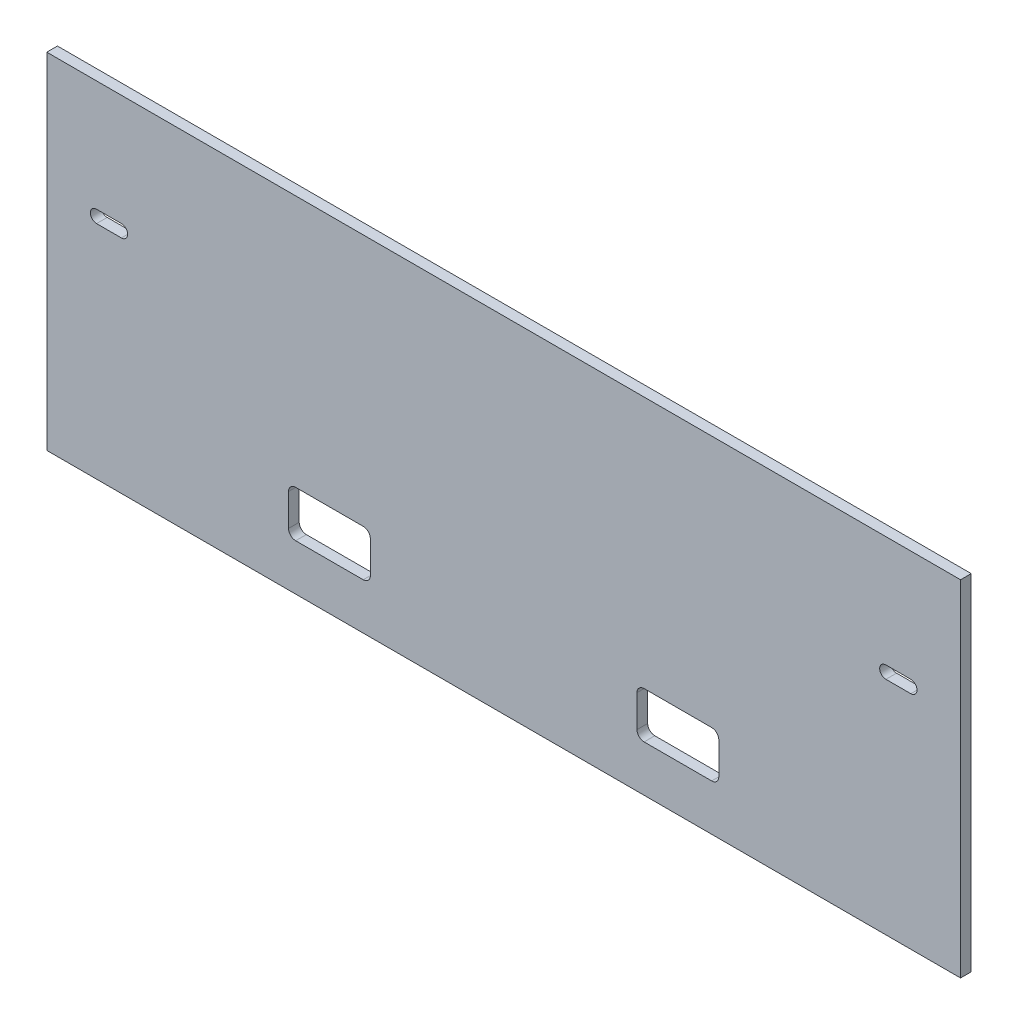
ISO-10303-21;
HEADER;
FILE_DESCRIPTION(('STEP AP214'),'2;1');
FILE_NAME('part.step','',(''),(''),'','','');
FILE_SCHEMA(('AUTOMOTIVE_DESIGN { 1 0 10303 214 1 1 1 1 }'));
ENDSEC;
DATA;
#1=APPLICATION_CONTEXT('core data for automotive mechanical design processes');
#2=APPLICATION_PROTOCOL_DEFINITION('international standard','automotive_design',2000,#1);
#3=PRODUCT_CONTEXT('',#1,'mechanical');
#4=PRODUCT('Part','Part','',(#3));
#5=PRODUCT_RELATED_PRODUCT_CATEGORY('part','',(#4));
#6=PRODUCT_DEFINITION_FORMATION('','',#4);
#7=PRODUCT_DEFINITION_CONTEXT('part definition',#1,'design');
#8=PRODUCT_DEFINITION('design','',#6,#7);
#9=PRODUCT_DEFINITION_SHAPE('','',#8);
#10=(LENGTH_UNIT() NAMED_UNIT(*) SI_UNIT(.MILLI.,.METRE.));
#11=(NAMED_UNIT(*) PLANE_ANGLE_UNIT() SI_UNIT($,.RADIAN.));
#12=(NAMED_UNIT(*) SI_UNIT($,.STERADIAN.) SOLID_ANGLE_UNIT());
#13=UNCERTAINTY_MEASURE_WITH_UNIT(LENGTH_MEASURE(1.E-05),#10,'distance_accuracy_value','');
#14=(GEOMETRIC_REPRESENTATION_CONTEXT(3) GLOBAL_UNCERTAINTY_ASSIGNED_CONTEXT((#13)) GLOBAL_UNIT_ASSIGNED_CONTEXT((#10,
#11,#12)) REPRESENTATION_CONTEXT('',''));
#15=CARTESIAN_POINT('',(0.,0.,0.));
#16=DIRECTION('',(0.,0.,1.));
#17=DIRECTION('',(1.,0.,0.));
#18=AXIS2_PLACEMENT_3D('',#15,#16,#17);
#19=CARTESIAN_POINT('',(0.,0.,3.));
#20=DIRECTION('',(0.,0.,-1.));
#21=DIRECTION('',(-1.,0.,0.));
#22=AXIS2_PLACEMENT_3D('',#19,#20,#21);
#23=PLANE('',#22);
#24=DIRECTION('',(1.,0.,0.));
#25=VECTOR('',#24,1.);
#26=CARTESIAN_POINT('',(-60.5,-35.5,3.));
#27=LINE('',#26,#25);
#28=CARTESIAN_POINT('',(-58.5,-35.5,3.));
#29=VERTEX_POINT('',#28);
#30=CARTESIAN_POINT('',(-39.5,-35.5,3.));
#31=VERTEX_POINT('',#30);
#32=EDGE_CURVE('E424',#29,#31,#27,.T.);
#33=ORIENTED_EDGE('',*,*,#32,.F.);
#34=CARTESIAN_POINT('',(-58.5,-33.5,3.));
#35=DIRECTION('',(0.,0.,-1.));
#36=DIRECTION('',(-1.,0.,0.));
#37=AXIS2_PLACEMENT_3D('',#34,#35,#36);
#38=CIRCLE('',#37,2.);
#39=CARTESIAN_POINT('',(-60.5,-33.5,3.));
#40=VERTEX_POINT('',#39);
#41=EDGE_CURVE('E388',#29,#40,#38,.T.);
#42=ORIENTED_EDGE('',*,*,#41,.T.);
#43=DIRECTION('',(0.,-1.,0.));
#44=VECTOR('',#43,1.);
#45=CARTESIAN_POINT('',(-60.5,-35.5,3.));
#46=LINE('',#45,#44);
#47=CARTESIAN_POINT('',(-60.5,-24.5,3.));
#48=VERTEX_POINT('',#47);
#49=EDGE_CURVE('E405',#48,#40,#46,.T.);
#50=ORIENTED_EDGE('',*,*,#49,.F.);
#51=CARTESIAN_POINT('',(-58.5,-24.5,3.));
#52=DIRECTION('',(0.,0.,-1.));
#53=DIRECTION('',(-1.,0.,0.));
#54=AXIS2_PLACEMENT_3D('',#51,#52,#53);
#55=CIRCLE('',#54,2.);
#56=CARTESIAN_POINT('',(-58.5,-22.5,3.));
#57=VERTEX_POINT('',#56);
#58=EDGE_CURVE('E51',#48,#57,#55,.T.);
#59=ORIENTED_EDGE('',*,*,#58,.T.);
#60=DIRECTION('',(-1.,0.,0.));
#61=VECTOR('',#60,1.);
#62=CARTESIAN_POINT('',(-60.5,-22.5,3.));
#63=LINE('',#62,#61);
#64=CARTESIAN_POINT('',(-39.5,-22.5,3.));
#65=VERTEX_POINT('',#64);
#66=EDGE_CURVE('E403',#65,#57,#63,.T.);
#67=ORIENTED_EDGE('',*,*,#66,.F.);
#68=CARTESIAN_POINT('',(-39.5,-24.5,3.));
#69=DIRECTION('',(0.,0.,-1.));
#70=DIRECTION('',(-1.,0.,0.));
#71=AXIS2_PLACEMENT_3D('',#68,#69,#70);
#72=CIRCLE('',#71,2.);
#73=CARTESIAN_POINT('',(-37.5,-24.5,3.));
#74=VERTEX_POINT('',#73);
#75=EDGE_CURVE('E396',#65,#74,#72,.T.);
#76=ORIENTED_EDGE('',*,*,#75,.T.);
#77=DIRECTION('',(0.,1.,0.));
#78=VECTOR('',#77,1.);
#79=CARTESIAN_POINT('',(-37.5,-35.5,3.));
#80=LINE('',#79,#78);
#81=CARTESIAN_POINT('',(-37.5,-33.5,3.));
#82=VERTEX_POINT('',#81);
#83=EDGE_CURVE('E410',#82,#74,#80,.T.);
#84=ORIENTED_EDGE('',*,*,#83,.F.);
#85=CARTESIAN_POINT('',(-39.5,-33.5,3.));
#86=DIRECTION('',(0.,0.,-1.));
#87=DIRECTION('',(-1.,0.,0.));
#88=AXIS2_PLACEMENT_3D('',#85,#86,#87);
#89=CIRCLE('',#88,2.);
#90=EDGE_CURVE('E392',#82,#31,#89,.T.);
#91=ORIENTED_EDGE('',*,*,#90,.T.);
#92=EDGE_LOOP('',(#33,#42,#50,#59,#67,#76,#84,#91));
#93=FACE_BOUND('',#92,.T.);
#94=DIRECTION('',(1.,0.,0.));
#95=VECTOR('',#94,1.);
#96=CARTESIAN_POINT('',(37.5,-35.5,3.));
#97=LINE('',#96,#95);
#98=CARTESIAN_POINT('',(39.5,-35.5,3.));
#99=VERTEX_POINT('',#98);
#100=CARTESIAN_POINT('',(58.5,-35.5,3.));
#101=VERTEX_POINT('',#100);
#102=EDGE_CURVE('E445',#99,#101,#97,.T.);
#103=ORIENTED_EDGE('',*,*,#102,.F.);
#104=CARTESIAN_POINT('',(39.5,-33.5,3.));
#105=DIRECTION('',(0.,0.,-1.));
#106=DIRECTION('',(-1.,0.,0.));
#107=AXIS2_PLACEMENT_3D('',#104,#105,#106);
#108=CIRCLE('',#107,2.);
#109=CARTESIAN_POINT('',(37.5,-33.5,3.));
#110=VERTEX_POINT('',#109);
#111=EDGE_CURVE('E372',#99,#110,#108,.T.);
#112=ORIENTED_EDGE('',*,*,#111,.T.);
#113=DIRECTION('',(0.,-1.,0.));
#114=VECTOR('',#113,1.);
#115=CARTESIAN_POINT('',(37.5,-35.5,3.));
#116=LINE('',#115,#114);
#117=CARTESIAN_POINT('',(37.5,-24.5,3.));
#118=VERTEX_POINT('',#117);
#119=EDGE_CURVE('E448',#118,#110,#116,.T.);
#120=ORIENTED_EDGE('',*,*,#119,.F.);
#121=CARTESIAN_POINT('',(39.5,-24.5,3.));
#122=DIRECTION('',(0.,0.,-1.));
#123=DIRECTION('',(-1.,0.,0.));
#124=AXIS2_PLACEMENT_3D('',#121,#122,#123);
#125=CIRCLE('',#124,2.);
#126=CARTESIAN_POINT('',(39.5,-22.5,3.));
#127=VERTEX_POINT('',#126);
#128=EDGE_CURVE('E384',#118,#127,#125,.T.);
#129=ORIENTED_EDGE('',*,*,#128,.T.);
#130=DIRECTION('',(-1.,0.,0.));
#131=VECTOR('',#130,1.);
#132=CARTESIAN_POINT('',(37.5,-22.5,3.));
#133=LINE('',#132,#131);
#134=CARTESIAN_POINT('',(58.5,-22.5,3.));
#135=VERTEX_POINT('',#134);
#136=EDGE_CURVE('E439',#135,#127,#133,.T.);
#137=ORIENTED_EDGE('',*,*,#136,.F.);
#138=CARTESIAN_POINT('',(58.5,-24.5,3.));
#139=DIRECTION('',(0.,0.,-1.));
#140=DIRECTION('',(-1.,0.,0.));
#141=AXIS2_PLACEMENT_3D('',#138,#139,#140);
#142=CIRCLE('',#141,2.);
#143=CARTESIAN_POINT('',(60.5,-24.5,3.));
#144=VERTEX_POINT('',#143);
#145=EDGE_CURVE('E380',#135,#144,#142,.T.);
#146=ORIENTED_EDGE('',*,*,#145,.T.);
#147=DIRECTION('',(0.,1.,0.));
#148=VECTOR('',#147,1.);
#149=CARTESIAN_POINT('',(60.5,-35.5,3.));
#150=LINE('',#149,#148);
#151=CARTESIAN_POINT('',(60.5,-33.5,3.));
#152=VERTEX_POINT('',#151);
#153=EDGE_CURVE('E442',#152,#144,#150,.T.);
#154=ORIENTED_EDGE('',*,*,#153,.F.);
#155=CARTESIAN_POINT('',(58.5,-33.5,3.));
#156=DIRECTION('',(0.,0.,-1.));
#157=DIRECTION('',(-1.,0.,0.));
#158=AXIS2_PLACEMENT_3D('',#155,#156,#157);
#159=CIRCLE('',#158,2.);
#160=EDGE_CURVE('E376',#152,#101,#159,.T.);
#161=ORIENTED_EDGE('',*,*,#160,.T.);
#162=EDGE_LOOP('',(#103,#112,#120,#129,#137,#146,#154,#161));
#163=FACE_BOUND('',#162,.T.);
#164=CARTESIAN_POINT('',(-114.5,15.5,3.));
#165=DIRECTION('',(0.,0.,1.));
#166=DIRECTION('',(1.,0.,0.));
#167=AXIS2_PLACEMENT_3D('',#164,#165,#166);
#168=CIRCLE('',#167,1.75);
#169=CARTESIAN_POINT('',(-114.5,17.25,3.));
#170=VERTEX_POINT('',#169);
#171=CARTESIAN_POINT('',(-114.5,13.75,3.));
#172=VERTEX_POINT('',#171);
#173=EDGE_CURVE('E273',#170,#172,#168,.T.);
#174=ORIENTED_EDGE('',*,*,#173,.F.);
#175=DIRECTION('',(-1.,0.,0.));
#176=VECTOR('',#175,1.);
#177=CARTESIAN_POINT('',(-114.5,17.25,3.));
#178=LINE('',#177,#176);
#179=CARTESIAN_POINT('',(-107.5,17.25,3.));
#180=VERTEX_POINT('',#179);
#181=EDGE_CURVE('E281',#180,#170,#178,.T.);
#182=ORIENTED_EDGE('',*,*,#181,.F.);
#183=CARTESIAN_POINT('',(-107.5,15.5,3.));
#184=DIRECTION('',(0.,0.,1.));
#185=DIRECTION('',(1.,0.,0.));
#186=AXIS2_PLACEMENT_3D('',#183,#184,#185);
#187=CIRCLE('',#186,1.75);
#188=CARTESIAN_POINT('',(-107.5,13.75,3.));
#189=VERTEX_POINT('',#188);
#190=EDGE_CURVE('E278',#189,#180,#187,.T.);
#191=ORIENTED_EDGE('',*,*,#190,.F.);
#192=DIRECTION('',(1.,0.,0.));
#193=VECTOR('',#192,1.);
#194=CARTESIAN_POINT('',(-114.5,13.75,3.));
#195=LINE('',#194,#193);
#196=EDGE_CURVE('E275',#172,#189,#195,.T.);
#197=ORIENTED_EDGE('',*,*,#196,.F.);
#198=EDGE_LOOP('',(#174,#182,#191,#197));
#199=FACE_BOUND('',#198,.T.);
#200=DIRECTION('',(0.,-1.,0.));
#201=VECTOR('',#200,1.);
#202=CARTESIAN_POINT('',(-128.5,48.5,3.));
#203=LINE('',#202,#201);
#204=CARTESIAN_POINT('',(-128.5,48.5,3.));
#205=VERTEX_POINT('',#204);
#206=CARTESIAN_POINT('',(-128.5,-48.5,3.));
#207=VERTEX_POINT('',#206);
#208=EDGE_CURVE('E304',#205,#207,#203,.T.);
#209=ORIENTED_EDGE('',*,*,#208,.T.);
#210=DIRECTION('',(1.,0.,0.));
#211=VECTOR('',#210,1.);
#212=CARTESIAN_POINT('',(128.5,-48.5,3.));
#213=LINE('',#212,#211);
#214=CARTESIAN_POINT('',(128.5,-48.5,3.));
#215=VERTEX_POINT('',#214);
#216=EDGE_CURVE('E307',#207,#215,#213,.T.);
#217=ORIENTED_EDGE('',*,*,#216,.T.);
#218=DIRECTION('',(0.,1.,0.));
#219=VECTOR('',#218,1.);
#220=CARTESIAN_POINT('',(128.5,48.5,3.));
#221=LINE('',#220,#219);
#222=CARTESIAN_POINT('',(128.5,48.5,3.));
#223=VERTEX_POINT('',#222);
#224=EDGE_CURVE('E310',#215,#223,#221,.T.);
#225=ORIENTED_EDGE('',*,*,#224,.T.);
#226=DIRECTION('',(-1.,0.,0.));
#227=VECTOR('',#226,1.);
#228=CARTESIAN_POINT('',(128.5,48.5,3.));
#229=LINE('',#228,#227);
#230=EDGE_CURVE('E312',#223,#205,#229,.T.);
#231=ORIENTED_EDGE('',*,*,#230,.T.);
#232=EDGE_LOOP('',(#209,#217,#225,#231));
#233=FACE_BOUND('',#232,.T.);
#234=CARTESIAN_POINT('',(107.5,15.5,3.));
#235=DIRECTION('',(0.,0.,1.));
#236=DIRECTION('',(1.,0.,0.));
#237=AXIS2_PLACEMENT_3D('',#234,#235,#236);
#238=CIRCLE('',#237,1.75);
#239=CARTESIAN_POINT('',(107.5,17.25,3.));
#240=VERTEX_POINT('',#239);
#241=CARTESIAN_POINT('',(107.5,13.75,3.));
#242=VERTEX_POINT('',#241);
#243=EDGE_CURVE('E230',#240,#242,#238,.T.);
#244=ORIENTED_EDGE('',*,*,#243,.F.);
#245=DIRECTION('',(-1.,0.,0.));
#246=VECTOR('',#245,1.);
#247=CARTESIAN_POINT('',(107.5,17.25,3.));
#248=LINE('',#247,#246);
#249=CARTESIAN_POINT('',(114.5,17.25,3.));
#250=VERTEX_POINT('',#249);
#251=EDGE_CURVE('E255',#250,#240,#248,.T.);
#252=ORIENTED_EDGE('',*,*,#251,.F.);
#253=CARTESIAN_POINT('',(114.5,15.5,3.));
#254=DIRECTION('',(0.,0.,1.));
#255=DIRECTION('',(1.,0.,0.));
#256=AXIS2_PLACEMENT_3D('',#253,#254,#255);
#257=CIRCLE('',#256,1.75);
#258=CARTESIAN_POINT('',(114.5,13.75,3.));
#259=VERTEX_POINT('',#258);
#260=EDGE_CURVE('E253',#259,#250,#257,.T.);
#261=ORIENTED_EDGE('',*,*,#260,.F.);
#262=DIRECTION('',(1.,0.,0.));
#263=VECTOR('',#262,1.);
#264=CARTESIAN_POINT('',(107.5,13.75,3.));
#265=LINE('',#264,#263);
#266=EDGE_CURVE('E240',#242,#259,#265,.T.);
#267=ORIENTED_EDGE('',*,*,#266,.F.);
#268=EDGE_LOOP('',(#244,#252,#261,#267));
#269=FACE_BOUND('',#268,.T.);
#270=ADVANCED_FACE('F43',(#93,#163,#199,#233,#269),#23,.F.);
#271=CARTESIAN_POINT('',(0.,0.,0.));
#272=DIRECTION('',(0.,0.,-1.));
#273=DIRECTION('',(-1.,0.,0.));
#274=AXIS2_PLACEMENT_3D('',#271,#272,#273);
#275=PLANE('',#274);
#276=DIRECTION('',(-1.,0.,0.));
#277=VECTOR('',#276,1.);
#278=CARTESIAN_POINT('',(-60.5,-22.5,0.));
#279=LINE('',#278,#277);
#280=CARTESIAN_POINT('',(-39.5,-22.5,0.));
#281=VERTEX_POINT('',#280);
#282=CARTESIAN_POINT('',(-58.5,-22.5,0.));
#283=VERTEX_POINT('',#282);
#284=EDGE_CURVE('E419',#281,#283,#279,.T.);
#285=ORIENTED_EDGE('',*,*,#284,.T.);
#286=CARTESIAN_POINT('',(-58.5,-24.5,0.));
#287=DIRECTION('',(0.,0.,-1.));
#288=DIRECTION('',(-1.,0.,0.));
#289=AXIS2_PLACEMENT_3D('',#286,#287,#288);
#290=CIRCLE('',#289,2.);
#291=CARTESIAN_POINT('',(-60.5,-24.5,0.));
#292=VERTEX_POINT('',#291);
#293=EDGE_CURVE('E11',#283,#292,#290,.F.);
#294=ORIENTED_EDGE('',*,*,#293,.T.);
#295=DIRECTION('',(0.,-1.,0.));
#296=VECTOR('',#295,1.);
#297=CARTESIAN_POINT('',(-60.5,-35.5,0.));
#298=LINE('',#297,#296);
#299=CARTESIAN_POINT('',(-60.5,-33.5,0.));
#300=VERTEX_POINT('',#299);
#301=EDGE_CURVE('E417',#292,#300,#298,.T.);
#302=ORIENTED_EDGE('',*,*,#301,.T.);
#303=CARTESIAN_POINT('',(-58.5,-33.5,0.));
#304=DIRECTION('',(0.,0.,-1.));
#305=DIRECTION('',(-1.,0.,0.));
#306=AXIS2_PLACEMENT_3D('',#303,#304,#305);
#307=CIRCLE('',#306,2.);
#308=CARTESIAN_POINT('',(-58.5,-35.5,0.));
#309=VERTEX_POINT('',#308);
#310=EDGE_CURVE('E390',#300,#309,#307,.F.);
#311=ORIENTED_EDGE('',*,*,#310,.T.);
#312=DIRECTION('',(1.,0.,0.));
#313=VECTOR('',#312,1.);
#314=CARTESIAN_POINT('',(-60.5,-35.5,0.));
#315=LINE('',#314,#313);
#316=CARTESIAN_POINT('',(-39.5,-35.5,0.));
#317=VERTEX_POINT('',#316);
#318=EDGE_CURVE('E262',#309,#317,#315,.T.);
#319=ORIENTED_EDGE('',*,*,#318,.T.);
#320=CARTESIAN_POINT('',(-39.5,-33.5,0.));
#321=DIRECTION('',(0.,0.,-1.));
#322=DIRECTION('',(-1.,0.,0.));
#323=AXIS2_PLACEMENT_3D('',#320,#321,#322);
#324=CIRCLE('',#323,2.);
#325=CARTESIAN_POINT('',(-37.5,-33.5,0.));
#326=VERTEX_POINT('',#325);
#327=EDGE_CURVE('E394',#317,#326,#324,.F.);
#328=ORIENTED_EDGE('',*,*,#327,.T.);
#329=DIRECTION('',(0.,1.,0.));
#330=VECTOR('',#329,1.);
#331=CARTESIAN_POINT('',(-37.5,-35.5,0.));
#332=LINE('',#331,#330);
#333=CARTESIAN_POINT('',(-37.5,-24.5,0.));
#334=VERTEX_POINT('',#333);
#335=EDGE_CURVE('E426',#326,#334,#332,.T.);
#336=ORIENTED_EDGE('',*,*,#335,.T.);
#337=CARTESIAN_POINT('',(-39.5,-24.5,0.));
#338=DIRECTION('',(0.,0.,-1.));
#339=DIRECTION('',(-1.,0.,0.));
#340=AXIS2_PLACEMENT_3D('',#337,#338,#339);
#341=CIRCLE('',#340,2.);
#342=EDGE_CURVE('E65',#334,#281,#341,.F.);
#343=ORIENTED_EDGE('',*,*,#342,.T.);
#344=EDGE_LOOP('',(#285,#294,#302,#311,#319,#328,#336,#343));
#345=FACE_BOUND('',#344,.T.);
#346=DIRECTION('',(-1.,0.,0.));
#347=VECTOR('',#346,1.);
#348=CARTESIAN_POINT('',(37.5,-22.5,0.));
#349=LINE('',#348,#347);
#350=CARTESIAN_POINT('',(58.5,-22.5,0.));
#351=VERTEX_POINT('',#350);
#352=CARTESIAN_POINT('',(39.5,-22.5,0.));
#353=VERTEX_POINT('',#352);
#354=EDGE_CURVE('E454',#351,#353,#349,.T.);
#355=ORIENTED_EDGE('',*,*,#354,.T.);
#356=CARTESIAN_POINT('',(39.5,-24.5,0.));
#357=DIRECTION('',(0.,0.,-1.));
#358=DIRECTION('',(-1.,0.,0.));
#359=AXIS2_PLACEMENT_3D('',#356,#357,#358);
#360=CIRCLE('',#359,2.);
#361=CARTESIAN_POINT('',(37.5,-24.5,0.));
#362=VERTEX_POINT('',#361);
#363=EDGE_CURVE('E386',#353,#362,#360,.F.);
#364=ORIENTED_EDGE('',*,*,#363,.T.);
#365=DIRECTION('',(0.,-1.,0.));
#366=VECTOR('',#365,1.);
#367=CARTESIAN_POINT('',(37.5,-35.5,0.));
#368=LINE('',#367,#366);
#369=CARTESIAN_POINT('',(37.5,-33.5,0.));
#370=VERTEX_POINT('',#369);
#371=EDGE_CURVE('E451',#362,#370,#368,.T.);
#372=ORIENTED_EDGE('',*,*,#371,.T.);
#373=CARTESIAN_POINT('',(39.5,-33.5,0.));
#374=DIRECTION('',(0.,0.,-1.));
#375=DIRECTION('',(-1.,0.,0.));
#376=AXIS2_PLACEMENT_3D('',#373,#374,#375);
#377=CIRCLE('',#376,2.);
#378=CARTESIAN_POINT('',(39.5,-35.5,0.));
#379=VERTEX_POINT('',#378);
#380=EDGE_CURVE('E374',#370,#379,#377,.F.);
#381=ORIENTED_EDGE('',*,*,#380,.T.);
#382=DIRECTION('',(1.,0.,0.));
#383=VECTOR('',#382,1.);
#384=CARTESIAN_POINT('',(37.5,-35.5,0.));
#385=LINE('',#384,#383);
#386=CARTESIAN_POINT('',(58.5,-35.5,0.));
#387=VERTEX_POINT('',#386);
#388=EDGE_CURVE('E436',#379,#387,#385,.T.);
#389=ORIENTED_EDGE('',*,*,#388,.T.);
#390=CARTESIAN_POINT('',(58.5,-33.5,0.));
#391=DIRECTION('',(0.,0.,-1.));
#392=DIRECTION('',(-1.,0.,0.));
#393=AXIS2_PLACEMENT_3D('',#390,#391,#392);
#394=CIRCLE('',#393,2.);
#395=CARTESIAN_POINT('',(60.5,-33.5,0.));
#396=VERTEX_POINT('',#395);
#397=EDGE_CURVE('E378',#387,#396,#394,.F.);
#398=ORIENTED_EDGE('',*,*,#397,.T.);
#399=DIRECTION('',(0.,1.,0.));
#400=VECTOR('',#399,1.);
#401=CARTESIAN_POINT('',(60.5,-35.5,0.));
#402=LINE('',#401,#400);
#403=CARTESIAN_POINT('',(60.5,-24.5,0.));
#404=VERTEX_POINT('',#403);
#405=EDGE_CURVE('E456',#396,#404,#402,.T.);
#406=ORIENTED_EDGE('',*,*,#405,.T.);
#407=CARTESIAN_POINT('',(58.5,-24.5,0.));
#408=DIRECTION('',(0.,0.,-1.));
#409=DIRECTION('',(-1.,0.,0.));
#410=AXIS2_PLACEMENT_3D('',#407,#408,#409);
#411=CIRCLE('',#410,2.);
#412=EDGE_CURVE('E382',#404,#351,#411,.F.);
#413=ORIENTED_EDGE('',*,*,#412,.T.);
#414=EDGE_LOOP('',(#355,#364,#372,#381,#389,#398,#406,#413));
#415=FACE_BOUND('',#414,.T.);
#416=DIRECTION('',(0.,-1.,0.));
#417=VECTOR('',#416,1.);
#418=CARTESIAN_POINT('',(-128.5,48.5,0.));
#419=LINE('',#418,#417);
#420=CARTESIAN_POINT('',(-128.5,48.5,0.));
#421=VERTEX_POINT('',#420);
#422=CARTESIAN_POINT('',(-128.5,-48.5,0.));
#423=VERTEX_POINT('',#422);
#424=EDGE_CURVE('E303',#421,#423,#419,.T.);
#425=ORIENTED_EDGE('',*,*,#424,.F.);
#426=DIRECTION('',(-1.,0.,0.));
#427=VECTOR('',#426,1.);
#428=CARTESIAN_POINT('',(128.5,48.5,0.));
#429=LINE('',#428,#427);
#430=CARTESIAN_POINT('',(128.5,48.5,0.));
#431=VERTEX_POINT('',#430);
#432=EDGE_CURVE('E308',#431,#421,#429,.T.);
#433=ORIENTED_EDGE('',*,*,#432,.F.);
#434=DIRECTION('',(0.,1.,0.));
#435=VECTOR('',#434,1.);
#436=CARTESIAN_POINT('',(128.5,48.5,0.));
#437=LINE('',#436,#435);
#438=CARTESIAN_POINT('',(128.5,-48.5,0.));
#439=VERTEX_POINT('',#438);
#440=EDGE_CURVE('E319',#439,#431,#437,.T.);
#441=ORIENTED_EDGE('',*,*,#440,.F.);
#442=DIRECTION('',(1.,0.,0.));
#443=VECTOR('',#442,1.);
#444=CARTESIAN_POINT('',(128.5,-48.5,0.));
#445=LINE('',#444,#443);
#446=EDGE_CURVE('E317',#423,#439,#445,.T.);
#447=ORIENTED_EDGE('',*,*,#446,.F.);
#448=EDGE_LOOP('',(#425,#433,#441,#447));
#449=FACE_BOUND('',#448,.T.);
#450=DIRECTION('',(-1.,0.,0.));
#451=VECTOR('',#450,1.);
#452=CARTESIAN_POINT('',(-114.5,17.25,0.));
#453=LINE('',#452,#451);
#454=CARTESIAN_POINT('',(-107.5,17.25,0.));
#455=VERTEX_POINT('',#454);
#456=CARTESIAN_POINT('',(-114.5,17.25,0.));
#457=VERTEX_POINT('',#456);
#458=EDGE_CURVE('E276',#455,#457,#453,.T.);
#459=ORIENTED_EDGE('',*,*,#458,.T.);
#460=CARTESIAN_POINT('',(-114.5,15.5,0.));
#461=DIRECTION('',(0.,0.,1.));
#462=DIRECTION('',(1.,0.,0.));
#463=AXIS2_PLACEMENT_3D('',#460,#461,#462);
#464=CIRCLE('',#463,1.75);
#465=CARTESIAN_POINT('',(-114.5,13.75,0.));
#466=VERTEX_POINT('',#465);
#467=EDGE_CURVE('E248',#457,#466,#464,.T.);
#468=ORIENTED_EDGE('',*,*,#467,.T.);
#469=DIRECTION('',(1.,0.,0.));
#470=VECTOR('',#469,1.);
#471=CARTESIAN_POINT('',(-114.5,13.75,0.));
#472=LINE('',#471,#470);
#473=CARTESIAN_POINT('',(-107.5,13.75,0.));
#474=VERTEX_POINT('',#473);
#475=EDGE_CURVE('E286',#466,#474,#472,.T.);
#476=ORIENTED_EDGE('',*,*,#475,.T.);
#477=CARTESIAN_POINT('',(-107.5,15.5,0.));
#478=DIRECTION('',(0.,0.,1.));
#479=DIRECTION('',(1.,0.,0.));
#480=AXIS2_PLACEMENT_3D('',#477,#478,#479);
#481=CIRCLE('',#480,1.75);
#482=EDGE_CURVE('E289',#474,#455,#481,.T.);
#483=ORIENTED_EDGE('',*,*,#482,.T.);
#484=EDGE_LOOP('',(#459,#468,#476,#483));
#485=FACE_BOUND('',#484,.T.);
#486=DIRECTION('',(-1.,0.,0.));
#487=VECTOR('',#486,1.);
#488=CARTESIAN_POINT('',(107.5,17.25,0.));
#489=LINE('',#488,#487);
#490=CARTESIAN_POINT('',(114.5,17.25,0.));
#491=VERTEX_POINT('',#490);
#492=CARTESIAN_POINT('',(107.5,17.25,0.));
#493=VERTEX_POINT('',#492);
#494=EDGE_CURVE('E241',#491,#493,#489,.T.);
#495=ORIENTED_EDGE('',*,*,#494,.T.);
#496=CARTESIAN_POINT('',(107.5,15.5,0.));
#497=DIRECTION('',(0.,0.,1.));
#498=DIRECTION('',(1.,0.,0.));
#499=AXIS2_PLACEMENT_3D('',#496,#497,#498);
#500=CIRCLE('',#499,1.75);
#501=CARTESIAN_POINT('',(107.5,13.75,0.));
#502=VERTEX_POINT('',#501);
#503=EDGE_CURVE('E260',#493,#502,#500,.T.);
#504=ORIENTED_EDGE('',*,*,#503,.T.);
#505=DIRECTION('',(1.,0.,0.));
#506=VECTOR('',#505,1.);
#507=CARTESIAN_POINT('',(107.5,13.75,0.));
#508=LINE('',#507,#506);
#509=CARTESIAN_POINT('',(114.5,13.75,0.));
#510=VERTEX_POINT('',#509);
#511=EDGE_CURVE('E247',#502,#510,#508,.T.);
#512=ORIENTED_EDGE('',*,*,#511,.T.);
#513=CARTESIAN_POINT('',(114.5,15.5,0.));
#514=DIRECTION('',(0.,0.,1.));
#515=DIRECTION('',(1.,0.,0.));
#516=AXIS2_PLACEMENT_3D('',#513,#514,#515);
#517=CIRCLE('',#516,1.75);
#518=EDGE_CURVE('E264',#510,#491,#517,.T.);
#519=ORIENTED_EDGE('',*,*,#518,.T.);
#520=EDGE_LOOP('',(#495,#504,#512,#519));
#521=FACE_BOUND('',#520,.T.);
#522=ADVANCED_FACE('F415',(#345,#415,#449,#485,#521),#275,.T.);
#523=CARTESIAN_POINT('',(-128.5,48.5,3.));
#524=DIRECTION('',(1.,0.,0.));
#525=DIRECTION('',(0.,0.,-1.));
#526=AXIS2_PLACEMENT_3D('',#523,#524,#525);
#527=PLANE('',#526);
#528=ORIENTED_EDGE('',*,*,#424,.T.);
#529=DIRECTION('',(0.,0.,-1.));
#530=VECTOR('',#529,1.);
#531=CARTESIAN_POINT('',(-128.5,-48.5,3.));
#532=LINE('',#531,#530);
#533=EDGE_CURVE('E330',#207,#423,#532,.T.);
#534=ORIENTED_EDGE('',*,*,#533,.F.);
#535=ORIENTED_EDGE('',*,*,#208,.F.);
#536=DIRECTION('',(0.,0.,-1.));
#537=VECTOR('',#536,1.);
#538=CARTESIAN_POINT('',(-128.5,48.5,3.));
#539=LINE('',#538,#537);
#540=EDGE_CURVE('E314',#205,#421,#539,.T.);
#541=ORIENTED_EDGE('',*,*,#540,.T.);
#542=EDGE_LOOP('',(#528,#534,#535,#541));
#543=FACE_BOUND('',#542,.T.);
#544=ADVANCED_FACE('F495',(#543),#527,.F.);
#545=CARTESIAN_POINT('',(128.5,-48.5,3.));
#546=DIRECTION('',(0.,1.,0.));
#547=DIRECTION('',(-1.,0.,0.));
#548=AXIS2_PLACEMENT_3D('',#545,#546,#547);
#549=PLANE('',#548);
#550=ORIENTED_EDGE('',*,*,#446,.T.);
#551=DIRECTION('',(0.,0.,-1.));
#552=VECTOR('',#551,1.);
#553=CARTESIAN_POINT('',(128.5,-48.5,3.));
#554=LINE('',#553,#552);
#555=EDGE_CURVE('E327',#215,#439,#554,.T.);
#556=ORIENTED_EDGE('',*,*,#555,.F.);
#557=ORIENTED_EDGE('',*,*,#216,.F.);
#558=ORIENTED_EDGE('',*,*,#533,.T.);
#559=EDGE_LOOP('',(#550,#556,#557,#558));
#560=FACE_BOUND('',#559,.T.);
#561=ADVANCED_FACE('F508',(#560),#549,.F.);
#562=CARTESIAN_POINT('',(128.5,48.5,3.));
#563=DIRECTION('',(-1.,0.,0.));
#564=DIRECTION('',(0.,0.,1.));
#565=AXIS2_PLACEMENT_3D('',#562,#563,#564);
#566=PLANE('',#565);
#567=ORIENTED_EDGE('',*,*,#440,.T.);
#568=DIRECTION('',(0.,0.,-1.));
#569=VECTOR('',#568,1.);
#570=CARTESIAN_POINT('',(128.5,48.5,3.));
#571=LINE('',#570,#569);
#572=EDGE_CURVE('E324',#223,#431,#571,.T.);
#573=ORIENTED_EDGE('',*,*,#572,.F.);
#574=ORIENTED_EDGE('',*,*,#224,.F.);
#575=ORIENTED_EDGE('',*,*,#555,.T.);
#576=EDGE_LOOP('',(#567,#573,#574,#575));
#577=FACE_BOUND('',#576,.T.);
#578=ADVANCED_FACE('F504',(#577),#566,.F.);
#579=CARTESIAN_POINT('',(128.5,48.5,3.));
#580=DIRECTION('',(0.,-1.,0.));
#581=DIRECTION('',(1.,0.,0.));
#582=AXIS2_PLACEMENT_3D('',#579,#580,#581);
#583=PLANE('',#582);
#584=ORIENTED_EDGE('',*,*,#432,.T.);
#585=ORIENTED_EDGE('',*,*,#540,.F.);
#586=ORIENTED_EDGE('',*,*,#230,.F.);
#587=ORIENTED_EDGE('',*,*,#572,.T.);
#588=EDGE_LOOP('',(#584,#585,#586,#587));
#589=FACE_BOUND('',#588,.T.);
#590=ADVANCED_FACE('F501',(#589),#583,.F.);
#591=CARTESIAN_POINT('',(-114.5,15.5,3.));
#592=DIRECTION('',(0.,0.,-1.));
#593=DIRECTION('',(-1.,0.,0.));
#594=AXIS2_PLACEMENT_3D('',#591,#592,#593);
#595=CYLINDRICAL_SURFACE('',#594,1.75);
#596=ORIENTED_EDGE('',*,*,#467,.F.);
#597=DIRECTION('',(0.,0.,-1.));
#598=VECTOR('',#597,1.);
#599=CARTESIAN_POINT('',(-114.5,17.25,3.));
#600=LINE('',#599,#598);
#601=EDGE_CURVE('E283',#170,#457,#600,.T.);
#602=ORIENTED_EDGE('',*,*,#601,.F.);
#603=ORIENTED_EDGE('',*,*,#173,.T.);
#604=DIRECTION('',(0.,0.,-1.));
#605=VECTOR('',#604,1.);
#606=CARTESIAN_POINT('',(-114.5,13.75,3.));
#607=LINE('',#606,#605);
#608=EDGE_CURVE('E300',#172,#466,#607,.T.);
#609=ORIENTED_EDGE('',*,*,#608,.T.);
#610=EDGE_LOOP('',(#596,#602,#603,#609));
#611=FACE_BOUND('',#610,.T.);
#612=ADVANCED_FACE('F498',(#611),#595,.F.);
#613=CARTESIAN_POINT('',(-114.5,13.75,3.));
#614=DIRECTION('',(0.,1.,0.));
#615=DIRECTION('',(-1.,0.,0.));
#616=AXIS2_PLACEMENT_3D('',#613,#614,#615);
#617=PLANE('',#616);
#618=ORIENTED_EDGE('',*,*,#475,.F.);
#619=ORIENTED_EDGE('',*,*,#608,.F.);
#620=ORIENTED_EDGE('',*,*,#196,.T.);
#621=DIRECTION('',(0.,0.,-1.));
#622=VECTOR('',#621,1.);
#623=CARTESIAN_POINT('',(-107.5,13.75,3.));
#624=LINE('',#623,#622);
#625=EDGE_CURVE('E298',#189,#474,#624,.T.);
#626=ORIENTED_EDGE('',*,*,#625,.T.);
#627=EDGE_LOOP('',(#618,#619,#620,#626));
#628=FACE_BOUND('',#627,.T.);
#629=ADVANCED_FACE('F596',(#628),#617,.T.);
#630=CARTESIAN_POINT('',(-107.5,15.5,3.));
#631=DIRECTION('',(0.,0.,-1.));
#632=DIRECTION('',(-1.,0.,0.));
#633=AXIS2_PLACEMENT_3D('',#630,#631,#632);
#634=CYLINDRICAL_SURFACE('',#633,1.75);
#635=ORIENTED_EDGE('',*,*,#482,.F.);
#636=ORIENTED_EDGE('',*,*,#625,.F.);
#637=ORIENTED_EDGE('',*,*,#190,.T.);
#638=DIRECTION('',(0.,0.,-1.));
#639=VECTOR('',#638,1.);
#640=CARTESIAN_POINT('',(-107.5,17.25,3.));
#641=LINE('',#640,#639);
#642=EDGE_CURVE('E296',#180,#455,#641,.T.);
#643=ORIENTED_EDGE('',*,*,#642,.T.);
#644=EDGE_LOOP('',(#635,#636,#637,#643));
#645=FACE_BOUND('',#644,.T.);
#646=ADVANCED_FACE('F593',(#645),#634,.F.);
#647=CARTESIAN_POINT('',(-114.5,17.25,3.));
#648=DIRECTION('',(0.,-1.,0.));
#649=DIRECTION('',(0.,0.,-1.));
#650=AXIS2_PLACEMENT_3D('',#647,#648,#649);
#651=PLANE('',#650);
#652=ORIENTED_EDGE('',*,*,#458,.F.);
#653=ORIENTED_EDGE('',*,*,#642,.F.);
#654=ORIENTED_EDGE('',*,*,#181,.T.);
#655=ORIENTED_EDGE('',*,*,#601,.T.);
#656=EDGE_LOOP('',(#652,#653,#654,#655));
#657=FACE_BOUND('',#656,.T.);
#658=ADVANCED_FACE('F590',(#657),#651,.T.);
#659=CARTESIAN_POINT('',(107.5,15.5,3.));
#660=DIRECTION('',(0.,0.,-1.));
#661=DIRECTION('',(-1.,0.,0.));
#662=AXIS2_PLACEMENT_3D('',#659,#660,#661);
#663=CYLINDRICAL_SURFACE('',#662,1.75);
#664=ORIENTED_EDGE('',*,*,#503,.F.);
#665=DIRECTION('',(0.,0.,-1.));
#666=VECTOR('',#665,1.);
#667=CARTESIAN_POINT('',(107.5,17.25,3.));
#668=LINE('',#667,#666);
#669=EDGE_CURVE('E236',#240,#493,#668,.T.);
#670=ORIENTED_EDGE('',*,*,#669,.F.);
#671=ORIENTED_EDGE('',*,*,#243,.T.);
#672=DIRECTION('',(0.,0.,-1.));
#673=VECTOR('',#672,1.);
#674=CARTESIAN_POINT('',(107.5,13.75,3.));
#675=LINE('',#674,#673);
#676=EDGE_CURVE('E233',#242,#502,#675,.T.);
#677=ORIENTED_EDGE('',*,*,#676,.T.);
#678=EDGE_LOOP('',(#664,#670,#671,#677));
#679=FACE_BOUND('',#678,.T.);
#680=ADVANCED_FACE('F232',(#679),#663,.F.);
#681=CARTESIAN_POINT('',(107.5,13.75,3.));
#682=DIRECTION('',(0.,1.,0.));
#683=DIRECTION('',(-1.,0.,0.));
#684=AXIS2_PLACEMENT_3D('',#681,#682,#683);
#685=PLANE('',#684);
#686=ORIENTED_EDGE('',*,*,#511,.F.);
#687=ORIENTED_EDGE('',*,*,#676,.F.);
#688=ORIENTED_EDGE('',*,*,#266,.T.);
#689=DIRECTION('',(0.,0.,-1.));
#690=VECTOR('',#689,1.);
#691=CARTESIAN_POINT('',(114.5,13.75,3.));
#692=LINE('',#691,#690);
#693=EDGE_CURVE('E249',#259,#510,#692,.T.);
#694=ORIENTED_EDGE('',*,*,#693,.T.);
#695=EDGE_LOOP('',(#686,#687,#688,#694));
#696=FACE_BOUND('',#695,.T.);
#697=ADVANCED_FACE('F244',(#696),#685,.T.);
#698=CARTESIAN_POINT('',(114.5,15.5,3.));
#699=DIRECTION('',(0.,0.,-1.));
#700=DIRECTION('',(-1.,0.,0.));
#701=AXIS2_PLACEMENT_3D('',#698,#699,#700);
#702=CYLINDRICAL_SURFACE('',#701,1.75);
#703=ORIENTED_EDGE('',*,*,#518,.F.);
#704=ORIENTED_EDGE('',*,*,#693,.F.);
#705=ORIENTED_EDGE('',*,*,#260,.T.);
#706=DIRECTION('',(0.,0.,-1.));
#707=VECTOR('',#706,1.);
#708=CARTESIAN_POINT('',(114.5,17.25,3.));
#709=LINE('',#708,#707);
#710=EDGE_CURVE('E270',#250,#491,#709,.T.);
#711=ORIENTED_EDGE('',*,*,#710,.T.);
#712=EDGE_LOOP('',(#703,#704,#705,#711));
#713=FACE_BOUND('',#712,.T.);
#714=ADVANCED_FACE('F578',(#713),#702,.F.);
#715=CARTESIAN_POINT('',(107.5,17.25,3.));
#716=DIRECTION('',(0.,-1.,0.));
#717=DIRECTION('',(0.,0.,-1.));
#718=AXIS2_PLACEMENT_3D('',#715,#716,#717);
#719=PLANE('',#718);
#720=ORIENTED_EDGE('',*,*,#494,.F.);
#721=ORIENTED_EDGE('',*,*,#710,.F.);
#722=ORIENTED_EDGE('',*,*,#251,.T.);
#723=ORIENTED_EDGE('',*,*,#669,.T.);
#724=EDGE_LOOP('',(#720,#721,#722,#723));
#725=FACE_BOUND('',#724,.T.);
#726=ADVANCED_FACE('F576',(#725),#719,.T.);
#727=CARTESIAN_POINT('',(37.5,-35.5,-0.00100000000000013));
#728=DIRECTION('',(-1.,0.,0.));
#729=DIRECTION('',(0.,0.,1.));
#730=AXIS2_PLACEMENT_3D('',#727,#728,#729);
#731=PLANE('',#730);
#732=ORIENTED_EDGE('',*,*,#119,.T.);
#733=DIRECTION('',(0.,0.,1.));
#734=VECTOR('',#733,1.);
#735=CARTESIAN_POINT('',(37.5,-33.5,0.));
#736=LINE('',#735,#734);
#737=EDGE_CURVE('E341',#110,#370,#736,.F.);
#738=ORIENTED_EDGE('',*,*,#737,.T.);
#739=ORIENTED_EDGE('',*,*,#371,.F.);
#740=DIRECTION('',(0.,0.,1.));
#741=VECTOR('',#740,1.);
#742=CARTESIAN_POINT('',(37.5,-24.5,3.));
#743=LINE('',#742,#741);
#744=EDGE_CURVE('E338',#362,#118,#743,.T.);
#745=ORIENTED_EDGE('',*,*,#744,.T.);
#746=EDGE_LOOP('',(#732,#738,#739,#745));
#747=FACE_BOUND('',#746,.T.);
#748=ADVANCED_FACE('F541',(#747),#731,.F.);
#749=CARTESIAN_POINT('',(37.5,-22.5,-0.00100000000000013));
#750=DIRECTION('',(0.,1.,0.));
#751=DIRECTION('',(0.,0.,1.));
#752=AXIS2_PLACEMENT_3D('',#749,#750,#751);
#753=PLANE('',#752);
#754=ORIENTED_EDGE('',*,*,#354,.F.);
#755=DIRECTION('',(0.,0.,1.));
#756=VECTOR('',#755,1.);
#757=CARTESIAN_POINT('',(58.5,-22.5,3.));
#758=LINE('',#757,#756);
#759=EDGE_CURVE('E350',#351,#135,#758,.T.);
#760=ORIENTED_EDGE('',*,*,#759,.T.);
#761=ORIENTED_EDGE('',*,*,#136,.T.);
#762=DIRECTION('',(0.,0.,1.));
#763=VECTOR('',#762,1.);
#764=CARTESIAN_POINT('',(39.5,-22.5,0.));
#765=LINE('',#764,#763);
#766=EDGE_CURVE('E348',#127,#353,#765,.F.);
#767=ORIENTED_EDGE('',*,*,#766,.T.);
#768=EDGE_LOOP('',(#754,#760,#761,#767));
#769=FACE_BOUND('',#768,.T.);
#770=ADVANCED_FACE('F534',(#769),#753,.F.);
#771=CARTESIAN_POINT('',(60.5,-35.5,-0.00100000000000013));
#772=DIRECTION('',(1.,0.,0.));
#773=DIRECTION('',(0.,1.,0.));
#774=AXIS2_PLACEMENT_3D('',#771,#772,#773);
#775=PLANE('',#774);
#776=ORIENTED_EDGE('',*,*,#405,.F.);
#777=DIRECTION('',(0.,0.,1.));
#778=VECTOR('',#777,1.);
#779=CARTESIAN_POINT('',(60.5,-33.5,3.));
#780=LINE('',#779,#778);
#781=EDGE_CURVE('E345',#396,#152,#780,.T.);
#782=ORIENTED_EDGE('',*,*,#781,.T.);
#783=ORIENTED_EDGE('',*,*,#153,.T.);
#784=DIRECTION('',(0.,0.,1.));
#785=VECTOR('',#784,1.);
#786=CARTESIAN_POINT('',(60.5,-24.5,0.));
#787=LINE('',#786,#785);
#788=EDGE_CURVE('E343',#144,#404,#787,.F.);
#789=ORIENTED_EDGE('',*,*,#788,.T.);
#790=EDGE_LOOP('',(#776,#782,#783,#789));
#791=FACE_BOUND('',#790,.T.);
#792=ADVANCED_FACE('F553',(#791),#775,.F.);
#793=CARTESIAN_POINT('',(37.5,-35.5,-0.00100000000000013));
#794=DIRECTION('',(0.,-1.,0.));
#795=DIRECTION('',(0.,0.,-1.));
#796=AXIS2_PLACEMENT_3D('',#793,#794,#795);
#797=PLANE('',#796);
#798=ORIENTED_EDGE('',*,*,#388,.F.);
#799=DIRECTION('',(0.,0.,1.));
#800=VECTOR('',#799,1.);
#801=CARTESIAN_POINT('',(39.5,-35.5,3.));
#802=LINE('',#801,#800);
#803=EDGE_CURVE('E335',#379,#99,#802,.T.);
#804=ORIENTED_EDGE('',*,*,#803,.T.);
#805=ORIENTED_EDGE('',*,*,#102,.T.);
#806=DIRECTION('',(0.,0.,1.));
#807=VECTOR('',#806,1.);
#808=CARTESIAN_POINT('',(58.5,-35.5,0.));
#809=LINE('',#808,#807);
#810=EDGE_CURVE('E333',#101,#387,#809,.F.);
#811=ORIENTED_EDGE('',*,*,#810,.T.);
#812=EDGE_LOOP('',(#798,#804,#805,#811));
#813=FACE_BOUND('',#812,.T.);
#814=ADVANCED_FACE('F548',(#813),#797,.F.);
#815=CARTESIAN_POINT('',(-60.5,-35.5,-0.00100000000000013));
#816=DIRECTION('',(-1.,0.,0.));
#817=DIRECTION('',(0.,0.,1.));
#818=AXIS2_PLACEMENT_3D('',#815,#816,#817);
#819=PLANE('',#818);
#820=ORIENTED_EDGE('',*,*,#49,.T.);
#821=DIRECTION('',(0.,0.,1.));
#822=VECTOR('',#821,1.);
#823=CARTESIAN_POINT('',(-60.5,-33.5,0.));
#824=LINE('',#823,#822);
#825=EDGE_CURVE('E361',#40,#300,#824,.F.);
#826=ORIENTED_EDGE('',*,*,#825,.T.);
#827=ORIENTED_EDGE('',*,*,#301,.F.);
#828=DIRECTION('',(0.,0.,1.));
#829=VECTOR('',#828,1.);
#830=CARTESIAN_POINT('',(-60.5,-24.5,3.));
#831=LINE('',#830,#829);
#832=EDGE_CURVE('E358',#292,#48,#831,.T.);
#833=ORIENTED_EDGE('',*,*,#832,.T.);
#834=EDGE_LOOP('',(#820,#826,#827,#833));
#835=FACE_BOUND('',#834,.T.);
#836=ADVANCED_FACE('F421',(#835),#819,.F.);
#837=CARTESIAN_POINT('',(-60.5,-22.5,-0.00100000000000013));
#838=DIRECTION('',(0.,1.,0.));
#839=DIRECTION('',(-1.,0.,0.));
#840=AXIS2_PLACEMENT_3D('',#837,#838,#839);
#841=PLANE('',#840);
#842=ORIENTED_EDGE('',*,*,#284,.F.);
#843=DIRECTION('',(0.,0.,1.));
#844=VECTOR('',#843,1.);
#845=CARTESIAN_POINT('',(-39.5,-22.5,3.));
#846=LINE('',#845,#844);
#847=EDGE_CURVE('E369',#281,#65,#846,.T.);
#848=ORIENTED_EDGE('',*,*,#847,.T.);
#849=ORIENTED_EDGE('',*,*,#66,.T.);
#850=DIRECTION('',(0.,0.,1.));
#851=VECTOR('',#850,1.);
#852=CARTESIAN_POINT('',(-58.5,-22.5,0.));
#853=LINE('',#852,#851);
#854=EDGE_CURVE('E58',#57,#283,#853,.F.);
#855=ORIENTED_EDGE('',*,*,#854,.T.);
#856=EDGE_LOOP('',(#842,#848,#849,#855));
#857=FACE_BOUND('',#856,.T.);
#858=ADVANCED_FACE('F408',(#857),#841,.F.);
#859=CARTESIAN_POINT('',(-37.5,-35.5,-0.00100000000000013));
#860=DIRECTION('',(1.,0.,0.));
#861=DIRECTION('',(0.,1.,0.));
#862=AXIS2_PLACEMENT_3D('',#859,#860,#861);
#863=PLANE('',#862);
#864=ORIENTED_EDGE('',*,*,#335,.F.);
#865=DIRECTION('',(0.,0.,1.));
#866=VECTOR('',#865,1.);
#867=CARTESIAN_POINT('',(-37.5,-33.5,3.));
#868=LINE('',#867,#866);
#869=EDGE_CURVE('E365',#326,#82,#868,.T.);
#870=ORIENTED_EDGE('',*,*,#869,.T.);
#871=ORIENTED_EDGE('',*,*,#83,.T.);
#872=DIRECTION('',(0.,0.,1.));
#873=VECTOR('',#872,1.);
#874=CARTESIAN_POINT('',(-37.5,-24.5,0.));
#875=LINE('',#874,#873);
#876=EDGE_CURVE('E363',#74,#334,#875,.F.);
#877=ORIENTED_EDGE('',*,*,#876,.T.);
#878=EDGE_LOOP('',(#864,#870,#871,#877));
#879=FACE_BOUND('',#878,.T.);
#880=ADVANCED_FACE('F468',(#879),#863,.F.);
#881=CARTESIAN_POINT('',(-60.5,-35.5,-0.00100000000000013));
#882=DIRECTION('',(0.,-1.,0.));
#883=DIRECTION('',(0.,0.,-1.));
#884=AXIS2_PLACEMENT_3D('',#881,#882,#883);
#885=PLANE('',#884);
#886=ORIENTED_EDGE('',*,*,#318,.F.);
#887=DIRECTION('',(0.,0.,1.));
#888=VECTOR('',#887,1.);
#889=CARTESIAN_POINT('',(-58.5,-35.5,3.));
#890=LINE('',#889,#888);
#891=EDGE_CURVE('E355',#309,#29,#890,.T.);
#892=ORIENTED_EDGE('',*,*,#891,.T.);
#893=ORIENTED_EDGE('',*,*,#32,.T.);
#894=DIRECTION('',(0.,0.,1.));
#895=VECTOR('',#894,1.);
#896=CARTESIAN_POINT('',(-39.5,-35.5,0.));
#897=LINE('',#896,#895);
#898=EDGE_CURVE('E353',#31,#317,#897,.F.);
#899=ORIENTED_EDGE('',*,*,#898,.T.);
#900=EDGE_LOOP('',(#886,#892,#893,#899));
#901=FACE_BOUND('',#900,.T.);
#902=ADVANCED_FACE('F474',(#901),#885,.F.);
#903=CARTESIAN_POINT('',(39.5,-33.5,-0.00100000000000013));
#904=DIRECTION('',(0.,0.,-1.));
#905=DIRECTION('',(-1.,0.,0.));
#906=AXIS2_PLACEMENT_3D('',#903,#904,#905);
#907=CYLINDRICAL_SURFACE('',#906,2.);
#908=ORIENTED_EDGE('',*,*,#380,.F.);
#909=ORIENTED_EDGE('',*,*,#737,.F.);
#910=ORIENTED_EDGE('',*,*,#111,.F.);
#911=ORIENTED_EDGE('',*,*,#803,.F.);
#912=EDGE_LOOP('',(#908,#909,#910,#911));
#913=FACE_BOUND('',#912,.T.);
#914=ADVANCED_FACE('F516',(#913),#907,.F.);
#915=CARTESIAN_POINT('',(58.5,-33.5,-0.00100000000000013));
#916=DIRECTION('',(0.,0.,-1.));
#917=DIRECTION('',(-1.,0.,0.));
#918=AXIS2_PLACEMENT_3D('',#915,#916,#917);
#919=CYLINDRICAL_SURFACE('',#918,2.);
#920=ORIENTED_EDGE('',*,*,#397,.F.);
#921=ORIENTED_EDGE('',*,*,#810,.F.);
#922=ORIENTED_EDGE('',*,*,#160,.F.);
#923=ORIENTED_EDGE('',*,*,#781,.F.);
#924=EDGE_LOOP('',(#920,#921,#922,#923));
#925=FACE_BOUND('',#924,.T.);
#926=ADVANCED_FACE('F519',(#925),#919,.F.);
#927=CARTESIAN_POINT('',(58.5,-24.5,-0.00100000000000013));
#928=DIRECTION('',(0.,0.,-1.));
#929=DIRECTION('',(-1.,0.,0.));
#930=AXIS2_PLACEMENT_3D('',#927,#928,#929);
#931=CYLINDRICAL_SURFACE('',#930,2.);
#932=ORIENTED_EDGE('',*,*,#412,.F.);
#933=ORIENTED_EDGE('',*,*,#788,.F.);
#934=ORIENTED_EDGE('',*,*,#145,.F.);
#935=ORIENTED_EDGE('',*,*,#759,.F.);
#936=EDGE_LOOP('',(#932,#933,#934,#935));
#937=FACE_BOUND('',#936,.T.);
#938=ADVANCED_FACE('F486',(#937),#931,.F.);
#939=CARTESIAN_POINT('',(39.5,-24.5,-0.00100000000000013));
#940=DIRECTION('',(0.,0.,-1.));
#941=DIRECTION('',(-1.,0.,0.));
#942=AXIS2_PLACEMENT_3D('',#939,#940,#941);
#943=CYLINDRICAL_SURFACE('',#942,2.);
#944=ORIENTED_EDGE('',*,*,#363,.F.);
#945=ORIENTED_EDGE('',*,*,#766,.F.);
#946=ORIENTED_EDGE('',*,*,#128,.F.);
#947=ORIENTED_EDGE('',*,*,#744,.F.);
#948=EDGE_LOOP('',(#944,#945,#946,#947));
#949=FACE_BOUND('',#948,.T.);
#950=ADVANCED_FACE('F479',(#949),#943,.F.);
#951=CARTESIAN_POINT('',(-58.5,-33.5,-0.00100000000000013));
#952=DIRECTION('',(0.,0.,-1.));
#953=DIRECTION('',(-1.,0.,0.));
#954=AXIS2_PLACEMENT_3D('',#951,#952,#953);
#955=CYLINDRICAL_SURFACE('',#954,2.);
#956=ORIENTED_EDGE('',*,*,#310,.F.);
#957=ORIENTED_EDGE('',*,*,#825,.F.);
#958=ORIENTED_EDGE('',*,*,#41,.F.);
#959=ORIENTED_EDGE('',*,*,#891,.F.);
#960=EDGE_LOOP('',(#956,#957,#958,#959));
#961=FACE_BOUND('',#960,.T.);
#962=ADVANCED_FACE('F477',(#961),#955,.F.);
#963=CARTESIAN_POINT('',(-39.5,-33.5,-0.00100000000000013));
#964=DIRECTION('',(0.,0.,-1.));
#965=DIRECTION('',(-1.,0.,0.));
#966=AXIS2_PLACEMENT_3D('',#963,#964,#965);
#967=CYLINDRICAL_SURFACE('',#966,2.);
#968=ORIENTED_EDGE('',*,*,#327,.F.);
#969=ORIENTED_EDGE('',*,*,#898,.F.);
#970=ORIENTED_EDGE('',*,*,#90,.F.);
#971=ORIENTED_EDGE('',*,*,#869,.F.);
#972=EDGE_LOOP('',(#968,#969,#970,#971));
#973=FACE_BOUND('',#972,.T.);
#974=ADVANCED_FACE('F470',(#973),#967,.F.);
#975=CARTESIAN_POINT('',(-39.5,-24.5,-0.00100000000000013));
#976=DIRECTION('',(0.,0.,-1.));
#977=DIRECTION('',(-1.,0.,0.));
#978=AXIS2_PLACEMENT_3D('',#975,#976,#977);
#979=CYLINDRICAL_SURFACE('',#978,2.);
#980=ORIENTED_EDGE('',*,*,#342,.F.);
#981=ORIENTED_EDGE('',*,*,#876,.F.);
#982=ORIENTED_EDGE('',*,*,#75,.F.);
#983=ORIENTED_EDGE('',*,*,#847,.F.);
#984=EDGE_LOOP('',(#980,#981,#982,#983));
#985=FACE_BOUND('',#984,.T.);
#986=ADVANCED_FACE('F466',(#985),#979,.F.);
#987=CARTESIAN_POINT('',(-58.5,-24.5,-0.00100000000000013));
#988=DIRECTION('',(0.,0.,-1.));
#989=DIRECTION('',(-1.,0.,0.));
#990=AXIS2_PLACEMENT_3D('',#987,#988,#989);
#991=CYLINDRICAL_SURFACE('',#990,2.);
#992=ORIENTED_EDGE('',*,*,#293,.F.);
#993=ORIENTED_EDGE('',*,*,#854,.F.);
#994=ORIENTED_EDGE('',*,*,#58,.F.);
#995=ORIENTED_EDGE('',*,*,#832,.F.);
#996=EDGE_LOOP('',(#992,#993,#994,#995));
#997=FACE_BOUND('',#996,.T.);
#998=ADVANCED_FACE('F45',(#997),#991,.F.);
#999=CLOSED_SHELL('',(#270,#522,#544,#561,#578,#590,#612,#629,#646,#658,#680,#697,#714,#726,
#748,#770,#792,#814,#836,#858,#880,#902,#914,#926,#938,#950,#962,#974,#986,#998));
#1000=MANIFOLD_SOLID_BREP('B2',#999);
#1001=ADVANCED_BREP_SHAPE_REPRESENTATION('',(#18,#1000),#14);
#1002=SHAPE_DEFINITION_REPRESENTATION(#9,#1001);
ENDSEC;
END-ISO-10303-21;
